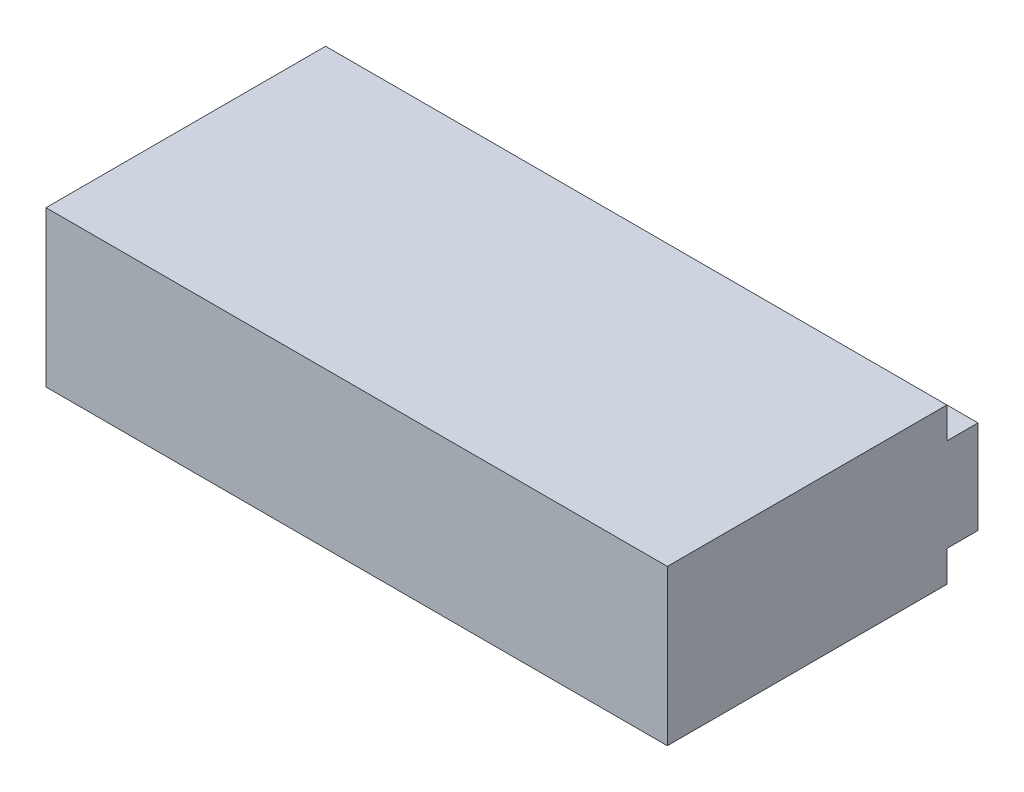
ISO-10303-21;
HEADER;
FILE_DESCRIPTION(('STEP AP214'),'2;1');
FILE_NAME('part.step','',(''),(''),'','','');
FILE_SCHEMA(('AUTOMOTIVE_DESIGN { 1 0 10303 214 1 1 1 1 }'));
ENDSEC;
DATA;
#1=APPLICATION_CONTEXT('core data for automotive mechanical design processes');
#2=APPLICATION_PROTOCOL_DEFINITION('international standard','automotive_design',2000,#1);
#3=PRODUCT_CONTEXT('',#1,'mechanical');
#4=PRODUCT('Part','Part','',(#3));
#5=PRODUCT_RELATED_PRODUCT_CATEGORY('part','',(#4));
#6=PRODUCT_DEFINITION_FORMATION('','',#4);
#7=PRODUCT_DEFINITION_CONTEXT('part definition',#1,'design');
#8=PRODUCT_DEFINITION('design','',#6,#7);
#9=PRODUCT_DEFINITION_SHAPE('','',#8);
#10=(LENGTH_UNIT() NAMED_UNIT(*) SI_UNIT(.MILLI.,.METRE.));
#11=(NAMED_UNIT(*) PLANE_ANGLE_UNIT() SI_UNIT($,.RADIAN.));
#12=(NAMED_UNIT(*) SI_UNIT($,.STERADIAN.) SOLID_ANGLE_UNIT());
#13=UNCERTAINTY_MEASURE_WITH_UNIT(LENGTH_MEASURE(1.E-05),#10,'distance_accuracy_value','');
#14=(GEOMETRIC_REPRESENTATION_CONTEXT(3) GLOBAL_UNCERTAINTY_ASSIGNED_CONTEXT((#13)) GLOBAL_UNIT_ASSIGNED_CONTEXT((#10,
#11,#12)) REPRESENTATION_CONTEXT('',''));
#15=CARTESIAN_POINT('',(0.,0.,0.));
#16=DIRECTION('',(0.,0.,1.));
#17=DIRECTION('',(1.,0.,0.));
#18=AXIS2_PLACEMENT_3D('',#15,#16,#17);
#19=CARTESIAN_POINT('',(-5.,1.25,5.));
#20=DIRECTION('',(1.,0.,0.));
#21=DIRECTION('',(0.,0.,-1.));
#22=AXIS2_PLACEMENT_3D('',#19,#20,#21);
#23=PLANE('',#22);
#24=DIRECTION('',(0.,0.,1.));
#25=VECTOR('',#24,1.);
#26=CARTESIAN_POINT('',(-5.,-0.749999999999999,0.));
#27=LINE('',#26,#25);
#28=CARTESIAN_POINT('',(-5.,-0.749999999999999,0.));
#29=VERTEX_POINT('',#28);
#30=CARTESIAN_POINT('',(-5.,-0.749999999999999,0.5));
#31=VERTEX_POINT('',#30);
#32=EDGE_CURVE('E47',#29,#31,#27,.T.);
#33=ORIENTED_EDGE('',*,*,#32,.T.);
#34=DIRECTION('',(0.,-1.,0.));
#35=VECTOR('',#34,1.);
#36=CARTESIAN_POINT('',(-5.,-1.25,0.5));
#37=LINE('',#36,#35);
#38=CARTESIAN_POINT('',(-5.,-1.25,0.5));
#39=VERTEX_POINT('',#38);
#40=EDGE_CURVE('E107',#31,#39,#37,.T.);
#41=ORIENTED_EDGE('',*,*,#40,.T.);
#42=DIRECTION('',(0.,0.,-1.));
#43=VECTOR('',#42,1.);
#44=CARTESIAN_POINT('',(-5.,-1.25,5.));
#45=LINE('',#44,#43);
#46=CARTESIAN_POINT('',(-5.,-1.25,5.));
#47=VERTEX_POINT('',#46);
#48=EDGE_CURVE('E11',#47,#39,#45,.T.);
#49=ORIENTED_EDGE('',*,*,#48,.F.);
#50=DIRECTION('',(0.,-1.,0.));
#51=VECTOR('',#50,1.);
#52=CARTESIAN_POINT('',(-5.,1.25,5.));
#53=LINE('',#52,#51);
#54=CARTESIAN_POINT('',(-5.,1.25,5.));
#55=VERTEX_POINT('',#54);
#56=EDGE_CURVE('E145',#55,#47,#53,.T.);
#57=ORIENTED_EDGE('',*,*,#56,.F.);
#58=DIRECTION('',(0.,0.,-1.));
#59=VECTOR('',#58,1.);
#60=CARTESIAN_POINT('',(-5.,1.25,5.));
#61=LINE('',#60,#59);
#62=CARTESIAN_POINT('',(-5.,1.25,0.5));
#63=VERTEX_POINT('',#62);
#64=EDGE_CURVE('E154',#55,#63,#61,.T.);
#65=ORIENTED_EDGE('',*,*,#64,.T.);
#66=DIRECTION('',(0.,-1.,0.));
#67=VECTOR('',#66,1.);
#68=CARTESIAN_POINT('',(-5.,1.25,0.5));
#69=LINE('',#68,#67);
#70=CARTESIAN_POINT('',(-5.,0.75,0.5));
#71=VERTEX_POINT('',#70);
#72=EDGE_CURVE('E129',#63,#71,#69,.T.);
#73=ORIENTED_EDGE('',*,*,#72,.T.);
#74=DIRECTION('',(0.,0.,-1.));
#75=VECTOR('',#74,1.);
#76=CARTESIAN_POINT('',(-5.,0.750000000000001,0.));
#77=LINE('',#76,#75);
#78=CARTESIAN_POINT('',(-5.,0.750000000000001,0.));
#79=VERTEX_POINT('',#78);
#80=EDGE_CURVE('E132',#71,#79,#77,.T.);
#81=ORIENTED_EDGE('',*,*,#80,.T.);
#82=DIRECTION('',(0.,-1.,0.));
#83=VECTOR('',#82,1.);
#84=CARTESIAN_POINT('',(-5.,1.25,0.));
#85=LINE('',#84,#83);
#86=EDGE_CURVE('E116',#79,#29,#85,.T.);
#87=ORIENTED_EDGE('',*,*,#86,.T.);
#88=EDGE_LOOP('',(#33,#41,#49,#57,#65,#73,#81,#87));
#89=FACE_BOUND('',#88,.T.);
#90=ADVANCED_FACE('F33',(#89),#23,.F.);
#91=CARTESIAN_POINT('',(5.,-1.25,5.));
#92=DIRECTION('',(0.,1.,0.));
#93=DIRECTION('',(-1.,0.,0.));
#94=AXIS2_PLACEMENT_3D('',#91,#92,#93);
#95=PLANE('',#94);
#96=ORIENTED_EDGE('',*,*,#48,.T.);
#97=DIRECTION('',(1.,0.,0.));
#98=VECTOR('',#97,1.);
#99=CARTESIAN_POINT('',(-5.,-1.25,0.5));
#100=LINE('',#99,#98);
#101=CARTESIAN_POINT('',(5.,-1.25,0.5));
#102=VERTEX_POINT('',#101);
#103=EDGE_CURVE('E103',#39,#102,#100,.T.);
#104=ORIENTED_EDGE('',*,*,#103,.T.);
#105=DIRECTION('',(0.,0.,-1.));
#106=VECTOR('',#105,1.);
#107=CARTESIAN_POINT('',(5.,-1.25,5.));
#108=LINE('',#107,#106);
#109=CARTESIAN_POINT('',(5.,-1.25,5.));
#110=VERTEX_POINT('',#109);
#111=EDGE_CURVE('E40',#110,#102,#108,.T.);
#112=ORIENTED_EDGE('',*,*,#111,.F.);
#113=DIRECTION('',(1.,0.,0.));
#114=VECTOR('',#113,1.);
#115=CARTESIAN_POINT('',(5.,-1.25,5.));
#116=LINE('',#115,#114);
#117=EDGE_CURVE('E148',#47,#110,#116,.T.);
#118=ORIENTED_EDGE('',*,*,#117,.F.);
#119=EDGE_LOOP('',(#96,#104,#112,#118));
#120=FACE_BOUND('',#119,.T.);
#121=ADVANCED_FACE('F167',(#120),#95,.F.);
#122=CARTESIAN_POINT('',(5.,1.25,5.));
#123=DIRECTION('',(-1.,0.,0.));
#124=DIRECTION('',(0.,0.,1.));
#125=AXIS2_PLACEMENT_3D('',#122,#123,#124);
#126=PLANE('',#125);
#127=ORIENTED_EDGE('',*,*,#111,.T.);
#128=DIRECTION('',(0.,-1.,0.));
#129=VECTOR('',#128,1.);
#130=CARTESIAN_POINT('',(5.,-1.25,0.5));
#131=LINE('',#130,#129);
#132=CARTESIAN_POINT('',(5.,-0.749999999999999,0.5));
#133=VERTEX_POINT('',#132);
#134=EDGE_CURVE('E117',#133,#102,#131,.T.);
#135=ORIENTED_EDGE('',*,*,#134,.F.);
#136=DIRECTION('',(0.,0.,1.));
#137=VECTOR('',#136,1.);
#138=CARTESIAN_POINT('',(5.,-0.749999999999999,0.));
#139=LINE('',#138,#137);
#140=CARTESIAN_POINT('',(5.,-0.749999999999999,0.));
#141=VERTEX_POINT('',#140);
#142=EDGE_CURVE('E100',#141,#133,#139,.T.);
#143=ORIENTED_EDGE('',*,*,#142,.F.);
#144=DIRECTION('',(0.,1.,0.));
#145=VECTOR('',#144,1.);
#146=CARTESIAN_POINT('',(5.,1.25,0.));
#147=LINE('',#146,#145);
#148=CARTESIAN_POINT('',(5.,0.75,0.));
#149=VERTEX_POINT('',#148);
#150=EDGE_CURVE('E55',#141,#149,#147,.T.);
#151=ORIENTED_EDGE('',*,*,#150,.T.);
#152=DIRECTION('',(0.,0.,-1.));
#153=VECTOR('',#152,1.);
#154=CARTESIAN_POINT('',(5.,0.750000000000001,0.));
#155=LINE('',#154,#153);
#156=CARTESIAN_POINT('',(5.,0.75,0.5));
#157=VERTEX_POINT('',#156);
#158=EDGE_CURVE('E133',#157,#149,#155,.T.);
#159=ORIENTED_EDGE('',*,*,#158,.F.);
#160=DIRECTION('',(0.,-1.,0.));
#161=VECTOR('',#160,1.);
#162=CARTESIAN_POINT('',(5.,1.25,0.5));
#163=LINE('',#162,#161);
#164=CARTESIAN_POINT('',(5.,1.25,0.5));
#165=VERTEX_POINT('',#164);
#166=EDGE_CURVE('E126',#165,#157,#163,.T.);
#167=ORIENTED_EDGE('',*,*,#166,.F.);
#168=DIRECTION('',(0.,0.,-1.));
#169=VECTOR('',#168,1.);
#170=CARTESIAN_POINT('',(5.,1.25,5.));
#171=LINE('',#170,#169);
#172=CARTESIAN_POINT('',(5.,1.25,5.));
#173=VERTEX_POINT('',#172);
#174=EDGE_CURVE('E159',#173,#165,#171,.T.);
#175=ORIENTED_EDGE('',*,*,#174,.F.);
#176=DIRECTION('',(0.,1.,0.));
#177=VECTOR('',#176,1.);
#178=CARTESIAN_POINT('',(5.,1.25,5.));
#179=LINE('',#178,#177);
#180=EDGE_CURVE('E150',#110,#173,#179,.T.);
#181=ORIENTED_EDGE('',*,*,#180,.F.);
#182=EDGE_LOOP('',(#127,#135,#143,#151,#159,#167,#175,#181));
#183=FACE_BOUND('',#182,.T.);
#184=ADVANCED_FACE('F164',(#183),#126,.F.);
#185=CARTESIAN_POINT('',(5.,1.25,5.));
#186=DIRECTION('',(0.,-1.,0.));
#187=DIRECTION('',(1.,0.,0.));
#188=AXIS2_PLACEMENT_3D('',#185,#186,#187);
#189=PLANE('',#188);
#190=ORIENTED_EDGE('',*,*,#174,.T.);
#191=DIRECTION('',(1.,0.,0.));
#192=VECTOR('',#191,1.);
#193=CARTESIAN_POINT('',(-5.,1.25,0.5));
#194=LINE('',#193,#192);
#195=EDGE_CURVE('E135',#63,#165,#194,.T.);
#196=ORIENTED_EDGE('',*,*,#195,.F.);
#197=ORIENTED_EDGE('',*,*,#64,.F.);
#198=DIRECTION('',(-1.,0.,0.));
#199=VECTOR('',#198,1.);
#200=CARTESIAN_POINT('',(5.,1.25,5.));
#201=LINE('',#200,#199);
#202=EDGE_CURVE('E152',#173,#55,#201,.T.);
#203=ORIENTED_EDGE('',*,*,#202,.F.);
#204=EDGE_LOOP('',(#190,#196,#197,#203));
#205=FACE_BOUND('',#204,.T.);
#206=ADVANCED_FACE('F175',(#205),#189,.F.);
#207=CARTESIAN_POINT('',(0.,0.,5.));
#208=DIRECTION('',(0.,0.,-1.));
#209=DIRECTION('',(-1.,0.,0.));
#210=AXIS2_PLACEMENT_3D('',#207,#208,#209);
#211=PLANE('',#210);
#212=ORIENTED_EDGE('',*,*,#56,.T.);
#213=ORIENTED_EDGE('',*,*,#117,.T.);
#214=ORIENTED_EDGE('',*,*,#180,.T.);
#215=ORIENTED_EDGE('',*,*,#202,.T.);
#216=EDGE_LOOP('',(#212,#213,#214,#215));
#217=FACE_BOUND('',#216,.T.);
#218=ADVANCED_FACE('F171',(#217),#211,.F.);
#219=CARTESIAN_POINT('',(0.,0.,0.));
#220=DIRECTION('',(0.,0.,-1.));
#221=DIRECTION('',(-1.,0.,0.));
#222=AXIS2_PLACEMENT_3D('',#219,#220,#221);
#223=PLANE('',#222);
#224=CARTESIAN_POINT('',(2.54,0.,0.));
#225=DIRECTION('',(0.,0.,-1.));
#226=DIRECTION('',(-1.,0.,0.));
#227=AXIS2_PLACEMENT_3D('',#224,#225,#226);
#228=CIRCLE('',#227,0.25);
#229=CARTESIAN_POINT('',(2.29,0.,0.));
#230=VERTEX_POINT('',#229);
#231=EDGE_CURVE('E328',#230,#230,#228,.T.);
#232=ORIENTED_EDGE('',*,*,#231,.F.);
#233=EDGE_LOOP('',(#232));
#234=FACE_BOUND('',#233,.T.);
#235=CARTESIAN_POINT('',(-2.54,0.,0.));
#236=DIRECTION('',(0.,0.,-1.));
#237=DIRECTION('',(-1.,0.,0.));
#238=AXIS2_PLACEMENT_3D('',#235,#236,#237);
#239=CIRCLE('',#238,0.25);
#240=CARTESIAN_POINT('',(-2.79,0.,0.));
#241=VERTEX_POINT('',#240);
#242=EDGE_CURVE('E337',#241,#241,#239,.T.);
#243=ORIENTED_EDGE('',*,*,#242,.F.);
#244=EDGE_LOOP('',(#243));
#245=FACE_BOUND('',#244,.T.);
#246=CARTESIAN_POINT('',(0.,0.,0.));
#247=DIRECTION('',(0.,0.,-1.));
#248=DIRECTION('',(-1.,0.,0.));
#249=AXIS2_PLACEMENT_3D('',#246,#247,#248);
#250=CIRCLE('',#249,0.25);
#251=CARTESIAN_POINT('',(-0.25,0.,0.));
#252=VERTEX_POINT('',#251);
#253=EDGE_CURVE('E121',#252,#252,#250,.T.);
#254=ORIENTED_EDGE('',*,*,#253,.F.);
#255=EDGE_LOOP('',(#254));
#256=FACE_BOUND('',#255,.T.);
#257=DIRECTION('',(1.,0.,0.));
#258=VECTOR('',#257,1.);
#259=CARTESIAN_POINT('',(-5.,-0.749999999999999,0.));
#260=LINE('',#259,#258);
#261=EDGE_CURVE('E104',#29,#141,#260,.T.);
#262=ORIENTED_EDGE('',*,*,#261,.F.);
#263=ORIENTED_EDGE('',*,*,#86,.F.);
#264=DIRECTION('',(1.,0.,0.));
#265=VECTOR('',#264,1.);
#266=CARTESIAN_POINT('',(-5.,0.750000000000001,0.));
#267=LINE('',#266,#265);
#268=EDGE_CURVE('E139',#79,#149,#267,.T.);
#269=ORIENTED_EDGE('',*,*,#268,.T.);
#270=ORIENTED_EDGE('',*,*,#150,.F.);
#271=EDGE_LOOP('',(#262,#263,#269,#270));
#272=FACE_BOUND('',#271,.T.);
#273=ADVANCED_FACE('F183',(#234,#245,#256,#272),#223,.T.);
#274=CARTESIAN_POINT('',(-5.,0.750000000000001,0.));
#275=DIRECTION('',(0.,-1.,0.));
#276=DIRECTION('',(0.,0.,-1.));
#277=AXIS2_PLACEMENT_3D('',#274,#275,#276);
#278=PLANE('',#277);
#279=ORIENTED_EDGE('',*,*,#158,.T.);
#280=ORIENTED_EDGE('',*,*,#268,.F.);
#281=ORIENTED_EDGE('',*,*,#80,.F.);
#282=DIRECTION('',(1.,0.,0.));
#283=VECTOR('',#282,1.);
#284=CARTESIAN_POINT('',(-5.,0.75,0.5));
#285=LINE('',#284,#283);
#286=EDGE_CURVE('E142',#71,#157,#285,.T.);
#287=ORIENTED_EDGE('',*,*,#286,.T.);
#288=EDGE_LOOP('',(#279,#280,#281,#287));
#289=FACE_BOUND('',#288,.T.);
#290=ADVANCED_FACE('F180',(#289),#278,.F.);
#291=CARTESIAN_POINT('',(-5.,1.25,0.5));
#292=DIRECTION('',(0.,0.,1.));
#293=DIRECTION('',(1.,0.,0.));
#294=AXIS2_PLACEMENT_3D('',#291,#292,#293);
#295=PLANE('',#294);
#296=ORIENTED_EDGE('',*,*,#166,.T.);
#297=ORIENTED_EDGE('',*,*,#286,.F.);
#298=ORIENTED_EDGE('',*,*,#72,.F.);
#299=ORIENTED_EDGE('',*,*,#195,.T.);
#300=EDGE_LOOP('',(#296,#297,#298,#299));
#301=FACE_BOUND('',#300,.T.);
#302=ADVANCED_FACE('F178',(#301),#295,.F.);
#303=CARTESIAN_POINT('',(-5.,-1.25,0.5));
#304=DIRECTION('',(0.,0.,1.));
#305=DIRECTION('',(1.,0.,0.));
#306=AXIS2_PLACEMENT_3D('',#303,#304,#305);
#307=PLANE('',#306);
#308=ORIENTED_EDGE('',*,*,#134,.T.);
#309=ORIENTED_EDGE('',*,*,#103,.F.);
#310=ORIENTED_EDGE('',*,*,#40,.F.);
#311=DIRECTION('',(1.,0.,0.));
#312=VECTOR('',#311,1.);
#313=CARTESIAN_POINT('',(-5.,-0.749999999999999,0.5));
#314=LINE('',#313,#312);
#315=EDGE_CURVE('E97',#31,#133,#314,.T.);
#316=ORIENTED_EDGE('',*,*,#315,.T.);
#317=EDGE_LOOP('',(#308,#309,#310,#316));
#318=FACE_BOUND('',#317,.T.);
#319=ADVANCED_FACE('F108',(#318),#307,.F.);
#320=CARTESIAN_POINT('',(-5.,-0.749999999999999,0.));
#321=DIRECTION('',(0.,1.,0.));
#322=DIRECTION('',(0.,0.,1.));
#323=AXIS2_PLACEMENT_3D('',#320,#321,#322);
#324=PLANE('',#323);
#325=ORIENTED_EDGE('',*,*,#142,.T.);
#326=ORIENTED_EDGE('',*,*,#315,.F.);
#327=ORIENTED_EDGE('',*,*,#32,.F.);
#328=ORIENTED_EDGE('',*,*,#261,.T.);
#329=EDGE_LOOP('',(#325,#326,#327,#328));
#330=FACE_BOUND('',#329,.T.);
#331=ADVANCED_FACE('F99',(#330),#324,.F.);
#332=CARTESIAN_POINT('',(0.,0.,1.));
#333=DIRECTION('',(0.,0.,-1.));
#334=DIRECTION('',(-1.,0.,0.));
#335=AXIS2_PLACEMENT_3D('',#332,#333,#334);
#336=CYLINDRICAL_SURFACE('',#335,0.25);
#337=CARTESIAN_POINT('',(0.,0.,1.));
#338=DIRECTION('',(0.,0.,-1.));
#339=DIRECTION('',(-1.,0.,0.));
#340=AXIS2_PLACEMENT_3D('',#337,#338,#339);
#341=CIRCLE('',#340,0.25);
#342=CARTESIAN_POINT('',(-0.25,0.,1.));
#343=VERTEX_POINT('',#342);
#344=EDGE_CURVE('E124',#343,#343,#341,.T.);
#345=ORIENTED_EDGE('',*,*,#344,.F.);
#346=EDGE_LOOP('',(#345));
#347=FACE_BOUND('',#346,.T.);
#348=ORIENTED_EDGE('',*,*,#253,.T.);
#349=EDGE_LOOP('',(#348));
#350=FACE_BOUND('',#349,.T.);
#351=ADVANCED_FACE('F261',(#347,#350),#336,.F.);
#352=CARTESIAN_POINT('',(0.,0.,1.));
#353=DIRECTION('',(0.,0.,-1.));
#354=DIRECTION('',(-1.,0.,0.));
#355=AXIS2_PLACEMENT_3D('',#352,#353,#354);
#356=PLANE('',#355);
#357=ORIENTED_EDGE('',*,*,#344,.T.);
#358=EDGE_LOOP('',(#357));
#359=FACE_BOUND('',#358,.T.);
#360=ADVANCED_FACE('F268',(#359),#356,.T.);
#361=CARTESIAN_POINT('',(-2.54,0.,1.));
#362=DIRECTION('',(0.,0.,-1.));
#363=DIRECTION('',(-1.,0.,0.));
#364=AXIS2_PLACEMENT_3D('',#361,#362,#363);
#365=CYLINDRICAL_SURFACE('',#364,0.25);
#366=CARTESIAN_POINT('',(-2.54,0.,1.));
#367=DIRECTION('',(0.,0.,-1.));
#368=DIRECTION('',(-1.,0.,0.));
#369=AXIS2_PLACEMENT_3D('',#366,#367,#368);
#370=CIRCLE('',#369,0.25);
#371=CARTESIAN_POINT('',(-2.79,0.,1.));
#372=VERTEX_POINT('',#371);
#373=EDGE_CURVE('E332',#372,#372,#370,.T.);
#374=ORIENTED_EDGE('',*,*,#373,.F.);
#375=EDGE_LOOP('',(#374));
#376=FACE_BOUND('',#375,.T.);
#377=ORIENTED_EDGE('',*,*,#242,.T.);
#378=EDGE_LOOP('',(#377));
#379=FACE_BOUND('',#378,.T.);
#380=ADVANCED_FACE('F277',(#376,#379),#365,.F.);
#381=CARTESIAN_POINT('',(-2.54,0.,1.));
#382=DIRECTION('',(0.,0.,-1.));
#383=DIRECTION('',(-1.,0.,0.));
#384=AXIS2_PLACEMENT_3D('',#381,#382,#383);
#385=PLANE('',#384);
#386=ORIENTED_EDGE('',*,*,#373,.T.);
#387=EDGE_LOOP('',(#386));
#388=FACE_BOUND('',#387,.T.);
#389=ADVANCED_FACE('F286',(#388),#385,.T.);
#390=CARTESIAN_POINT('',(2.54,0.,1.));
#391=DIRECTION('',(0.,0.,-1.));
#392=DIRECTION('',(-1.,0.,0.));
#393=AXIS2_PLACEMENT_3D('',#390,#391,#392);
#394=CYLINDRICAL_SURFACE('',#393,0.25);
#395=CARTESIAN_POINT('',(2.54,0.,1.));
#396=DIRECTION('',(0.,0.,-1.));
#397=DIRECTION('',(-1.,0.,0.));
#398=AXIS2_PLACEMENT_3D('',#395,#396,#397);
#399=CIRCLE('',#398,0.25);
#400=CARTESIAN_POINT('',(2.29,0.,1.));
#401=VERTEX_POINT('',#400);
#402=EDGE_CURVE('E327',#401,#401,#399,.T.);
#403=ORIENTED_EDGE('',*,*,#402,.F.);
#404=EDGE_LOOP('',(#403));
#405=FACE_BOUND('',#404,.T.);
#406=ORIENTED_EDGE('',*,*,#231,.T.);
#407=EDGE_LOOP('',(#406));
#408=FACE_BOUND('',#407,.T.);
#409=ADVANCED_FACE('F295',(#405,#408),#394,.F.);
#410=CARTESIAN_POINT('',(2.54,0.,1.));
#411=DIRECTION('',(0.,0.,-1.));
#412=DIRECTION('',(-1.,0.,0.));
#413=AXIS2_PLACEMENT_3D('',#410,#411,#412);
#414=PLANE('',#413);
#415=ORIENTED_EDGE('',*,*,#402,.T.);
#416=EDGE_LOOP('',(#415));
#417=FACE_BOUND('',#416,.T.);
#418=ADVANCED_FACE('F304',(#417),#414,.T.);
#419=CLOSED_SHELL('',(#90,#121,#184,#206,#218,#273,#290,#302,#319,#331,#351,#360,#380,#389,#409,#418));
#420=MANIFOLD_SOLID_BREP('B2',#419);
#421=ADVANCED_BREP_SHAPE_REPRESENTATION('',(#18,#420),#14);
#422=SHAPE_DEFINITION_REPRESENTATION(#9,#421);
ENDSEC;
END-ISO-10303-21;
